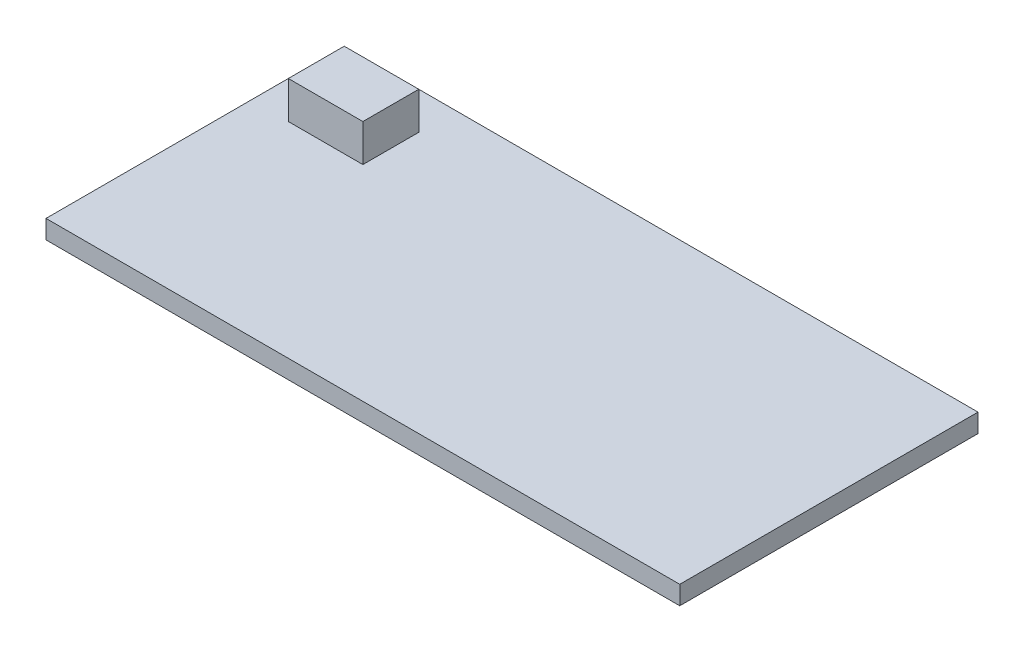
ISO-10303-21;
HEADER;
FILE_DESCRIPTION(('STEP AP214'),'2;1');
FILE_NAME('part.step','',(''),(''),'','','');
FILE_SCHEMA(('AUTOMOTIVE_DESIGN { 1 0 10303 214 1 1 1 1 }'));
ENDSEC;
DATA;
#1=APPLICATION_CONTEXT('core data for automotive mechanical design processes');
#2=APPLICATION_PROTOCOL_DEFINITION('international standard','automotive_design',2000,#1);
#3=PRODUCT_CONTEXT('',#1,'mechanical');
#4=PRODUCT('Part','Part','',(#3));
#5=PRODUCT_RELATED_PRODUCT_CATEGORY('part','',(#4));
#6=PRODUCT_DEFINITION_FORMATION('','',#4);
#7=PRODUCT_DEFINITION_CONTEXT('part definition',#1,'design');
#8=PRODUCT_DEFINITION('design','',#6,#7);
#9=PRODUCT_DEFINITION_SHAPE('','',#8);
#10=(LENGTH_UNIT() NAMED_UNIT(*) SI_UNIT(.MILLI.,.METRE.));
#11=(NAMED_UNIT(*) PLANE_ANGLE_UNIT() SI_UNIT($,.RADIAN.));
#12=(NAMED_UNIT(*) SI_UNIT($,.STERADIAN.) SOLID_ANGLE_UNIT());
#13=UNCERTAINTY_MEASURE_WITH_UNIT(LENGTH_MEASURE(1.E-05),#10,'distance_accuracy_value','');
#14=(GEOMETRIC_REPRESENTATION_CONTEXT(3) GLOBAL_UNCERTAINTY_ASSIGNED_CONTEXT((#13)) GLOBAL_UNIT_ASSIGNED_CONTEXT((#10,
#11,#12)) REPRESENTATION_CONTEXT('',''));
#15=CARTESIAN_POINT('',(0.,0.,0.));
#16=DIRECTION('',(0.,0.,1.));
#17=DIRECTION('',(1.,0.,0.));
#18=AXIS2_PLACEMENT_3D('',#15,#16,#17);
#19=CARTESIAN_POINT('',(0.,5.,0.));
#20=DIRECTION('',(0.,-1.,0.));
#21=DIRECTION('',(0.,0.,-1.));
#22=AXIS2_PLACEMENT_3D('',#19,#20,#21);
#23=PLANE('',#22);
#24=DIRECTION('',(0.,0.,1.));
#25=VECTOR('',#24,1.);
#26=CARTESIAN_POINT('',(0.,5.,0.));
#27=LINE('',#26,#25);
#28=CARTESIAN_POINT('',(0.,5.,-80.));
#29=VERTEX_POINT('',#28);
#30=CARTESIAN_POINT('',(0.,5.,0.));
#31=VERTEX_POINT('',#30);
#32=EDGE_CURVE('E128',#29,#31,#27,.T.);
#33=ORIENTED_EDGE('',*,*,#32,.T.);
#34=DIRECTION('',(1.,0.,0.));
#35=VECTOR('',#34,1.);
#36=CARTESIAN_POINT('',(0.,5.,0.));
#37=LINE('',#36,#35);
#38=CARTESIAN_POINT('',(170.,5.,0.));
#39=VERTEX_POINT('',#38);
#40=EDGE_CURVE('E131',#31,#39,#37,.T.);
#41=ORIENTED_EDGE('',*,*,#40,.T.);
#42=DIRECTION('',(0.,0.,-1.));
#43=VECTOR('',#42,1.);
#44=CARTESIAN_POINT('',(170.,5.,0.));
#45=LINE('',#44,#43);
#46=CARTESIAN_POINT('',(170.,5.,-80.));
#47=VERTEX_POINT('',#46);
#48=EDGE_CURVE('E134',#39,#47,#45,.T.);
#49=ORIENTED_EDGE('',*,*,#48,.T.);
#50=DIRECTION('',(-1.,0.,0.));
#51=VECTOR('',#50,1.);
#52=CARTESIAN_POINT('',(0.,5.,-80.));
#53=LINE('',#52,#51);
#54=EDGE_CURVE('E136',#47,#29,#53,.T.);
#55=ORIENTED_EDGE('',*,*,#54,.T.);
#56=EDGE_LOOP('',(#33,#41,#49,#55));
#57=FACE_BOUND('',#56,.T.);
#58=DIRECTION('',(0.,0.,1.));
#59=VECTOR('',#58,1.);
#60=CARTESIAN_POINT('',(10.,5.,-70.));
#61=LINE('',#60,#59);
#62=CARTESIAN_POINT('',(10.,5.,-70.));
#63=VERTEX_POINT('',#62);
#64=CARTESIAN_POINT('',(10.,5.,-55.));
#65=VERTEX_POINT('',#64);
#66=EDGE_CURVE('E118',#63,#65,#61,.T.);
#67=ORIENTED_EDGE('',*,*,#66,.F.);
#68=DIRECTION('',(-1.,0.,0.));
#69=VECTOR('',#68,1.);
#70=CARTESIAN_POINT('',(10.,5.,-70.));
#71=LINE('',#70,#69);
#72=CARTESIAN_POINT('',(30.,5.,-70.));
#73=VERTEX_POINT('',#72);
#74=EDGE_CURVE('E115',#73,#63,#71,.T.);
#75=ORIENTED_EDGE('',*,*,#74,.F.);
#76=DIRECTION('',(0.,0.,-1.));
#77=VECTOR('',#76,1.);
#78=CARTESIAN_POINT('',(30.,5.,-70.));
#79=LINE('',#78,#77);
#80=CARTESIAN_POINT('',(30.,5.,-55.));
#81=VERTEX_POINT('',#80);
#82=EDGE_CURVE('E53',#81,#73,#79,.T.);
#83=ORIENTED_EDGE('',*,*,#82,.F.);
#84=DIRECTION('',(1.,0.,0.));
#85=VECTOR('',#84,1.);
#86=CARTESIAN_POINT('',(10.,5.,-55.));
#87=LINE('',#86,#85);
#88=EDGE_CURVE('E48',#65,#81,#87,.T.);
#89=ORIENTED_EDGE('',*,*,#88,.F.);
#90=EDGE_LOOP('',(#67,#75,#83,#89));
#91=FACE_BOUND('',#90,.T.);
#92=ADVANCED_FACE('F33',(#57,#91),#23,.F.);
#93=CARTESIAN_POINT('',(0.,5.,0.));
#94=DIRECTION('',(1.,0.,0.));
#95=DIRECTION('',(0.,0.,-1.));
#96=AXIS2_PLACEMENT_3D('',#93,#94,#95);
#97=PLANE('',#96);
#98=DIRECTION('',(0.,0.,1.));
#99=VECTOR('',#98,1.);
#100=CARTESIAN_POINT('',(0.,0.,0.));
#101=LINE('',#100,#99);
#102=CARTESIAN_POINT('',(0.,0.,-80.));
#103=VERTEX_POINT('',#102);
#104=CARTESIAN_POINT('',(0.,0.,0.));
#105=VERTEX_POINT('',#104);
#106=EDGE_CURVE('E119',#103,#105,#101,.T.);
#107=ORIENTED_EDGE('',*,*,#106,.T.);
#108=DIRECTION('',(0.,-1.,0.));
#109=VECTOR('',#108,1.);
#110=CARTESIAN_POINT('',(0.,5.,0.));
#111=LINE('',#110,#109);
#112=EDGE_CURVE('E11',#31,#105,#111,.T.);
#113=ORIENTED_EDGE('',*,*,#112,.F.);
#114=ORIENTED_EDGE('',*,*,#32,.F.);
#115=DIRECTION('',(0.,-1.,0.));
#116=VECTOR('',#115,1.);
#117=CARTESIAN_POINT('',(0.,5.,-80.));
#118=LINE('',#117,#116);
#119=EDGE_CURVE('E137',#29,#103,#118,.T.);
#120=ORIENTED_EDGE('',*,*,#119,.T.);
#121=EDGE_LOOP('',(#107,#113,#114,#120));
#122=FACE_BOUND('',#121,.T.);
#123=ADVANCED_FACE('F35',(#122),#97,.F.);
#124=CARTESIAN_POINT('',(0.,5.,0.));
#125=DIRECTION('',(0.,0.,-1.));
#126=DIRECTION('',(-1.,0.,0.));
#127=AXIS2_PLACEMENT_3D('',#124,#125,#126);
#128=PLANE('',#127);
#129=DIRECTION('',(1.,0.,0.));
#130=VECTOR('',#129,1.);
#131=CARTESIAN_POINT('',(0.,0.,0.));
#132=LINE('',#131,#130);
#133=CARTESIAN_POINT('',(170.,0.,0.));
#134=VERTEX_POINT('',#133);
#135=EDGE_CURVE('E122',#105,#134,#132,.T.);
#136=ORIENTED_EDGE('',*,*,#135,.T.);
#137=DIRECTION('',(0.,-1.,0.));
#138=VECTOR('',#137,1.);
#139=CARTESIAN_POINT('',(170.,5.,0.));
#140=LINE('',#139,#138);
#141=EDGE_CURVE('E41',#39,#134,#140,.T.);
#142=ORIENTED_EDGE('',*,*,#141,.F.);
#143=ORIENTED_EDGE('',*,*,#40,.F.);
#144=ORIENTED_EDGE('',*,*,#112,.T.);
#145=EDGE_LOOP('',(#136,#142,#143,#144));
#146=FACE_BOUND('',#145,.T.);
#147=ADVANCED_FACE('F167',(#146),#128,.F.);
#148=CARTESIAN_POINT('',(170.,5.,0.));
#149=DIRECTION('',(-1.,0.,0.));
#150=DIRECTION('',(0.,0.,1.));
#151=AXIS2_PLACEMENT_3D('',#148,#149,#150);
#152=PLANE('',#151);
#153=DIRECTION('',(0.,0.,-1.));
#154=VECTOR('',#153,1.);
#155=CARTESIAN_POINT('',(170.,0.,0.));
#156=LINE('',#155,#154);
#157=CARTESIAN_POINT('',(170.,0.,-80.));
#158=VERTEX_POINT('',#157);
#159=EDGE_CURVE('E140',#134,#158,#156,.T.);
#160=ORIENTED_EDGE('',*,*,#159,.T.);
#161=DIRECTION('',(0.,-1.,0.));
#162=VECTOR('',#161,1.);
#163=CARTESIAN_POINT('',(170.,5.,-80.));
#164=LINE('',#163,#162);
#165=EDGE_CURVE('E145',#47,#158,#164,.T.);
#166=ORIENTED_EDGE('',*,*,#165,.F.);
#167=ORIENTED_EDGE('',*,*,#48,.F.);
#168=ORIENTED_EDGE('',*,*,#141,.T.);
#169=EDGE_LOOP('',(#160,#166,#167,#168));
#170=FACE_BOUND('',#169,.T.);
#171=ADVANCED_FACE('F152',(#170),#152,.F.);
#172=CARTESIAN_POINT('',(0.,5.,-80.));
#173=DIRECTION('',(0.,0.,1.));
#174=DIRECTION('',(1.,0.,0.));
#175=AXIS2_PLACEMENT_3D('',#172,#173,#174);
#176=PLANE('',#175);
#177=DIRECTION('',(-1.,0.,0.));
#178=VECTOR('',#177,1.);
#179=CARTESIAN_POINT('',(0.,0.,-80.));
#180=LINE('',#179,#178);
#181=EDGE_CURVE('E132',#158,#103,#180,.T.);
#182=ORIENTED_EDGE('',*,*,#181,.T.);
#183=ORIENTED_EDGE('',*,*,#119,.F.);
#184=ORIENTED_EDGE('',*,*,#54,.F.);
#185=ORIENTED_EDGE('',*,*,#165,.T.);
#186=EDGE_LOOP('',(#182,#183,#184,#185));
#187=FACE_BOUND('',#186,.T.);
#188=ADVANCED_FACE('F161',(#187),#176,.F.);
#189=CARTESIAN_POINT('',(0.,0.,0.));
#190=DIRECTION('',(0.,-1.,0.));
#191=DIRECTION('',(0.,0.,-1.));
#192=AXIS2_PLACEMENT_3D('',#189,#190,#191);
#193=PLANE('',#192);
#194=ORIENTED_EDGE('',*,*,#106,.F.);
#195=ORIENTED_EDGE('',*,*,#181,.F.);
#196=ORIENTED_EDGE('',*,*,#159,.F.);
#197=ORIENTED_EDGE('',*,*,#135,.F.);
#198=EDGE_LOOP('',(#194,#195,#196,#197));
#199=FACE_BOUND('',#198,.T.);
#200=ADVANCED_FACE('F158',(#199),#193,.T.);
#201=CARTESIAN_POINT('',(10.,15.,-70.));
#202=DIRECTION('',(1.,0.,0.));
#203=DIRECTION('',(0.,0.,-1.));
#204=AXIS2_PLACEMENT_3D('',#201,#202,#203);
#205=PLANE('',#204);
#206=ORIENTED_EDGE('',*,*,#66,.T.);
#207=DIRECTION('',(0.,-1.,0.));
#208=VECTOR('',#207,1.);
#209=CARTESIAN_POINT('',(10.,15.,-55.));
#210=LINE('',#209,#208);
#211=CARTESIAN_POINT('',(10.,15.,-55.));
#212=VERTEX_POINT('',#211);
#213=EDGE_CURVE('E99',#212,#65,#210,.T.);
#214=ORIENTED_EDGE('',*,*,#213,.F.);
#215=DIRECTION('',(0.,0.,1.));
#216=VECTOR('',#215,1.);
#217=CARTESIAN_POINT('',(10.,15.,-70.));
#218=LINE('',#217,#216);
#219=CARTESIAN_POINT('',(10.,15.,-70.));
#220=VERTEX_POINT('',#219);
#221=EDGE_CURVE('E106',#220,#212,#218,.T.);
#222=ORIENTED_EDGE('',*,*,#221,.F.);
#223=DIRECTION('',(0.,-1.,0.));
#224=VECTOR('',#223,1.);
#225=CARTESIAN_POINT('',(10.,15.,-70.));
#226=LINE('',#225,#224);
#227=EDGE_CURVE('E260',#220,#63,#226,.T.);
#228=ORIENTED_EDGE('',*,*,#227,.T.);
#229=EDGE_LOOP('',(#206,#214,#222,#228));
#230=FACE_BOUND('',#229,.T.);
#231=ADVANCED_FACE('F117',(#230),#205,.F.);
#232=CARTESIAN_POINT('',(10.,15.,-55.));
#233=DIRECTION('',(0.,0.,-1.));
#234=DIRECTION('',(-1.,0.,0.));
#235=AXIS2_PLACEMENT_3D('',#232,#233,#234);
#236=PLANE('',#235);
#237=ORIENTED_EDGE('',*,*,#88,.T.);
#238=DIRECTION('',(0.,-1.,0.));
#239=VECTOR('',#238,1.);
#240=CARTESIAN_POINT('',(30.,15.,-55.));
#241=LINE('',#240,#239);
#242=CARTESIAN_POINT('',(30.,15.,-55.));
#243=VERTEX_POINT('',#242);
#244=EDGE_CURVE('E102',#243,#81,#241,.T.);
#245=ORIENTED_EDGE('',*,*,#244,.F.);
#246=DIRECTION('',(1.,0.,0.));
#247=VECTOR('',#246,1.);
#248=CARTESIAN_POINT('',(10.,15.,-55.));
#249=LINE('',#248,#247);
#250=EDGE_CURVE('E95',#212,#243,#249,.T.);
#251=ORIENTED_EDGE('',*,*,#250,.F.);
#252=ORIENTED_EDGE('',*,*,#213,.T.);
#253=EDGE_LOOP('',(#237,#245,#251,#252));
#254=FACE_BOUND('',#253,.T.);
#255=ADVANCED_FACE('F97',(#254),#236,.F.);
#256=CARTESIAN_POINT('',(30.,15.,-70.));
#257=DIRECTION('',(-1.,0.,0.));
#258=DIRECTION('',(0.,0.,1.));
#259=AXIS2_PLACEMENT_3D('',#256,#257,#258);
#260=PLANE('',#259);
#261=ORIENTED_EDGE('',*,*,#82,.T.);
#262=DIRECTION('',(0.,-1.,0.));
#263=VECTOR('',#262,1.);
#264=CARTESIAN_POINT('',(30.,15.,-70.));
#265=LINE('',#264,#263);
#266=CARTESIAN_POINT('',(30.,15.,-70.));
#267=VERTEX_POINT('',#266);
#268=EDGE_CURVE('E124',#267,#73,#265,.T.);
#269=ORIENTED_EDGE('',*,*,#268,.F.);
#270=DIRECTION('',(0.,0.,-1.));
#271=VECTOR('',#270,1.);
#272=CARTESIAN_POINT('',(30.,15.,-70.));
#273=LINE('',#272,#271);
#274=EDGE_CURVE('E105',#243,#267,#273,.T.);
#275=ORIENTED_EDGE('',*,*,#274,.F.);
#276=ORIENTED_EDGE('',*,*,#244,.T.);
#277=EDGE_LOOP('',(#261,#269,#275,#276));
#278=FACE_BOUND('',#277,.T.);
#279=ADVANCED_FACE('F203',(#278),#260,.F.);
#280=CARTESIAN_POINT('',(10.,15.,-70.));
#281=DIRECTION('',(0.,0.,1.));
#282=DIRECTION('',(1.,0.,0.));
#283=AXIS2_PLACEMENT_3D('',#280,#281,#282);
#284=PLANE('',#283);
#285=ORIENTED_EDGE('',*,*,#74,.T.);
#286=ORIENTED_EDGE('',*,*,#227,.F.);
#287=DIRECTION('',(-1.,0.,0.));
#288=VECTOR('',#287,1.);
#289=CARTESIAN_POINT('',(10.,15.,-70.));
#290=LINE('',#289,#288);
#291=EDGE_CURVE('E111',#267,#220,#290,.T.);
#292=ORIENTED_EDGE('',*,*,#291,.F.);
#293=ORIENTED_EDGE('',*,*,#268,.T.);
#294=EDGE_LOOP('',(#285,#286,#292,#293));
#295=FACE_BOUND('',#294,.T.);
#296=ADVANCED_FACE('F209',(#295),#284,.F.);
#297=CARTESIAN_POINT('',(0.,15.,0.));
#298=DIRECTION('',(0.,1.,0.));
#299=DIRECTION('',(0.,0.,1.));
#300=AXIS2_PLACEMENT_3D('',#297,#298,#299);
#301=PLANE('',#300);
#302=ORIENTED_EDGE('',*,*,#221,.T.);
#303=ORIENTED_EDGE('',*,*,#250,.T.);
#304=ORIENTED_EDGE('',*,*,#274,.T.);
#305=ORIENTED_EDGE('',*,*,#291,.T.);
#306=EDGE_LOOP('',(#302,#303,#304,#305));
#307=FACE_BOUND('',#306,.T.);
#308=ADVANCED_FACE('F109',(#307),#301,.T.);
#309=CLOSED_SHELL('',(#92,#123,#147,#171,#188,#200,#231,#255,#279,#296,#308));
#310=MANIFOLD_SOLID_BREP('B2',#309);
#311=ADVANCED_BREP_SHAPE_REPRESENTATION('',(#18,#310),#14);
#312=SHAPE_DEFINITION_REPRESENTATION(#9,#311);
ENDSEC;
END-ISO-10303-21;
